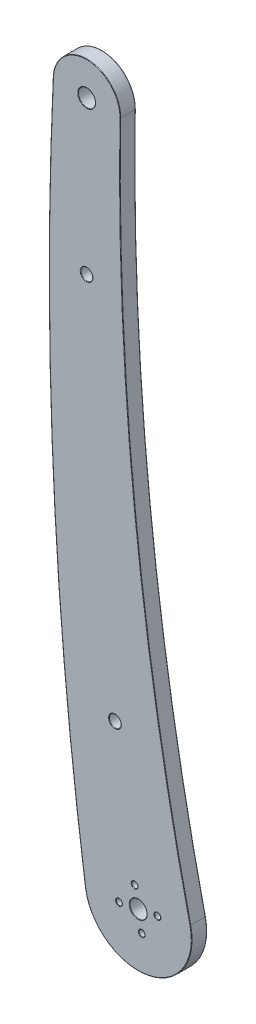
ISO-10303-21;
HEADER;
FILE_DESCRIPTION(('STEP AP214'),'2;1');
FILE_NAME('part.step','',(''),(''),'','','');
FILE_SCHEMA(('AUTOMOTIVE_DESIGN { 1 0 10303 214 1 1 1 1 }'));
ENDSEC;
DATA;
#1=APPLICATION_CONTEXT('core data for automotive mechanical design processes');
#2=APPLICATION_PROTOCOL_DEFINITION('international standard','automotive_design',2000,#1);
#3=PRODUCT_CONTEXT('',#1,'mechanical');
#4=PRODUCT('Part','Part','',(#3));
#5=PRODUCT_RELATED_PRODUCT_CATEGORY('part','',(#4));
#6=PRODUCT_DEFINITION_FORMATION('','',#4);
#7=PRODUCT_DEFINITION_CONTEXT('part definition',#1,'design');
#8=PRODUCT_DEFINITION('design','',#6,#7);
#9=PRODUCT_DEFINITION_SHAPE('','',#8);
#10=(LENGTH_UNIT() NAMED_UNIT(*) SI_UNIT(.MILLI.,.METRE.));
#11=(NAMED_UNIT(*) PLANE_ANGLE_UNIT() SI_UNIT($,.RADIAN.));
#12=(NAMED_UNIT(*) SI_UNIT($,.STERADIAN.) SOLID_ANGLE_UNIT());
#13=UNCERTAINTY_MEASURE_WITH_UNIT(LENGTH_MEASURE(1.E-05),#10,'distance_accuracy_value','');
#14=(GEOMETRIC_REPRESENTATION_CONTEXT(3) GLOBAL_UNCERTAINTY_ASSIGNED_CONTEXT((#13)) GLOBAL_UNIT_ASSIGNED_CONTEXT((#10,
#11,#12)) REPRESENTATION_CONTEXT('',''));
#15=CARTESIAN_POINT('',(0.,0.,0.));
#16=DIRECTION('',(0.,0.,1.));
#17=DIRECTION('',(1.,0.,0.));
#18=AXIS2_PLACEMENT_3D('',#15,#16,#17);
#19=CARTESIAN_POINT('',(-37.0776547455483,278.939028450343,-5.));
#20=DIRECTION('',(0.,0.,1.));
#21=DIRECTION('',(1.,0.,0.));
#22=AXIS2_PLACEMENT_3D('',#19,#20,#21);
#23=CYLINDRICAL_SURFACE('',#22,11.0000000000001);
#24=DIRECTION('',(0.,0.,1.));
#25=VECTOR('',#24,1.);
#26=CARTESIAN_POINT('',(-26.0791673880019,278.756611768298,-5.));
#27=LINE('',#26,#25);
#28=CARTESIAN_POINT('',(-26.0791673880019,278.756611768298,-4.85));
#29=VERTEX_POINT('',#28);
#30=CARTESIAN_POINT('',(-26.0791673880019,278.756611768298,-0.15));
#31=VERTEX_POINT('',#30);
#32=EDGE_CURVE('E111',#29,#31,#27,.T.);
#33=ORIENTED_EDGE('',*,*,#32,.F.);
#34=CARTESIAN_POINT('',(-37.0776547455483,278.939028450343,-4.85));
#35=DIRECTION('',(0.,0.,-1.));
#36=DIRECTION('',(-1.,0.,0.));
#37=AXIS2_PLACEMENT_3D('',#34,#35,#36);
#38=CIRCLE('',#37,11.0000000000001);
#39=CARTESIAN_POINT('',(-48.0655821267615,279.45424866073,-4.85));
#40=VERTEX_POINT('',#39);
#41=EDGE_CURVE('E106',#29,#40,#38,.F.);
#42=ORIENTED_EDGE('',*,*,#41,.T.);
#43=DIRECTION('',(0.,0.,1.));
#44=VECTOR('',#43,1.);
#45=CARTESIAN_POINT('',(-48.0655821267615,279.45424866073,-5.));
#46=LINE('',#45,#44);
#47=CARTESIAN_POINT('',(-48.0655821267615,279.45424866073,-0.15));
#48=VERTEX_POINT('',#47);
#49=EDGE_CURVE('E108',#40,#48,#46,.T.);
#50=ORIENTED_EDGE('',*,*,#49,.T.);
#51=CARTESIAN_POINT('',(-37.0776547455483,278.939028450343,-0.15));
#52=DIRECTION('',(0.,0.,-1.));
#53=DIRECTION('',(-1.,0.,0.));
#54=AXIS2_PLACEMENT_3D('',#51,#52,#53);
#55=CIRCLE('',#54,11.0000000000001);
#56=EDGE_CURVE('E118',#48,#31,#55,.T.);
#57=ORIENTED_EDGE('',*,*,#56,.T.);
#58=EDGE_LOOP('',(#33,#42,#50,#57));
#59=FACE_BOUND('',#58,.T.);
#60=ADVANCED_FACE('F39',(#59),#23,.T.);
#61=CARTESIAN_POINT('',(873.797070956716,263.831610510011,-5.));
#62=DIRECTION('',(0.,0.,1.));
#63=DIRECTION('',(1.,0.,0.));
#64=AXIS2_PLACEMENT_3D('',#61,#62,#63);
#65=CYLINDRICAL_SURFACE('',#64,900.);
#66=DIRECTION('',(0.,0.,1.));
#67=VECTOR('',#66,1.);
#68=CARTESIAN_POINT('',(-3.16790327875482,61.5139544238968,-5.));
#69=LINE('',#68,#67);
#70=CARTESIAN_POINT('',(-3.16790327875482,61.5139544238968,-4.85));
#71=VERTEX_POINT('',#70);
#72=CARTESIAN_POINT('',(-3.16790327875482,61.5139544238968,-0.15));
#73=VERTEX_POINT('',#72);
#74=EDGE_CURVE('E346',#71,#73,#69,.T.);
#75=ORIENTED_EDGE('',*,*,#74,.F.);
#76=CARTESIAN_POINT('',(873.797070956716,263.831610510011,-4.85));
#77=DIRECTION('',(0.,0.,-1.));
#78=DIRECTION('',(-1.,0.,0.));
#79=AXIS2_PLACEMENT_3D('',#76,#77,#78);
#80=CIRCLE('',#79,900.);
#81=EDGE_CURVE('E205',#71,#29,#80,.T.);
#82=ORIENTED_EDGE('',*,*,#81,.T.);
#83=ORIENTED_EDGE('',*,*,#32,.T.);
#84=CARTESIAN_POINT('',(873.797070956716,263.831610510011,-0.15));
#85=DIRECTION('',(0.,0.,-1.));
#86=DIRECTION('',(-1.,0.,0.));
#87=AXIS2_PLACEMENT_3D('',#84,#85,#86);
#88=CIRCLE('',#87,900.);
#89=EDGE_CURVE('E201',#31,#73,#88,.F.);
#90=ORIENTED_EDGE('',*,*,#89,.T.);
#91=EDGE_LOOP('',(#75,#82,#83,#90));
#92=FACE_BOUND('',#91,.T.);
#93=ADVANCED_FACE('F342',(#92),#65,.F.);
#94=CARTESIAN_POINT('',(-20.2199999999997,57.58,-5.));
#95=DIRECTION('',(0.,0.,1.));
#96=DIRECTION('',(1.,0.,0.));
#97=AXIS2_PLACEMENT_3D('',#94,#95,#96);
#98=CYLINDRICAL_SURFACE('',#97,17.4999999999997);
#99=DIRECTION('',(0.,0.,1.));
#100=VECTOR('',#99,1.);
#101=CARTESIAN_POINT('',(-37.5474034553959,55.1282476687248,-5.));
#102=LINE('',#101,#100);
#103=CARTESIAN_POINT('',(-37.5474034553959,55.1282476687248,-4.85));
#104=VERTEX_POINT('',#103);
#105=CARTESIAN_POINT('',(-37.5474034553959,55.1282476687248,-0.15));
#106=VERTEX_POINT('',#105);
#107=EDGE_CURVE('E130',#104,#106,#102,.T.);
#108=ORIENTED_EDGE('',*,*,#107,.F.);
#109=CARTESIAN_POINT('',(-20.2199999999997,57.58,-4.85));
#110=DIRECTION('',(0.,0.,-1.));
#111=DIRECTION('',(-1.,0.,0.));
#112=AXIS2_PLACEMENT_3D('',#109,#110,#111);
#113=CIRCLE('',#112,17.4999999999997);
#114=EDGE_CURVE('E198',#104,#71,#113,.F.);
#115=ORIENTED_EDGE('',*,*,#114,.T.);
#116=ORIENTED_EDGE('',*,*,#74,.T.);
#117=CARTESIAN_POINT('',(-20.2199999999997,57.58,-0.15));
#118=DIRECTION('',(0.,0.,-1.));
#119=DIRECTION('',(-1.,0.,0.));
#120=AXIS2_PLACEMENT_3D('',#117,#118,#119);
#121=CIRCLE('',#120,17.4999999999997);
#122=EDGE_CURVE('E195',#73,#106,#121,.T.);
#123=ORIENTED_EDGE('',*,*,#122,.T.);
#124=EDGE_LOOP('',(#108,#115,#116,#123));
#125=FACE_BOUND('',#124,.T.);
#126=ADVANCED_FACE('F398',(#125),#98,.T.);
#127=CARTESIAN_POINT('',(1150.61740491465,223.248407527602,-5.));
#128=DIRECTION('',(0.,0.,1.));
#129=DIRECTION('',(1.,0.,0.));
#130=AXIS2_PLACEMENT_3D('',#127,#128,#129);
#131=CYLINDRICAL_SURFACE('',#130,1200.);
#132=ORIENTED_EDGE('',*,*,#49,.F.);
#133=CARTESIAN_POINT('',(1150.61740491465,223.248407527602,-4.85));
#134=DIRECTION('',(0.,0.,-1.));
#135=DIRECTION('',(-1.,0.,0.));
#136=AXIS2_PLACEMENT_3D('',#133,#134,#135);
#137=CIRCLE('',#136,1200.);
#138=EDGE_CURVE('E125',#40,#104,#137,.F.);
#139=ORIENTED_EDGE('',*,*,#138,.T.);
#140=ORIENTED_EDGE('',*,*,#107,.T.);
#141=CARTESIAN_POINT('',(1150.61740491465,223.248407527602,-0.15));
#142=DIRECTION('',(0.,0.,-1.));
#143=DIRECTION('',(-1.,0.,0.));
#144=AXIS2_PLACEMENT_3D('',#141,#142,#143);
#145=CIRCLE('',#144,1200.);
#146=EDGE_CURVE('E128',#106,#48,#145,.T.);
#147=ORIENTED_EDGE('',*,*,#146,.T.);
#148=EDGE_LOOP('',(#132,#139,#140,#147));
#149=FACE_BOUND('',#148,.T.);
#150=ADVANCED_FACE('F122',(#149),#131,.T.);
#151=CARTESIAN_POINT('',(418.359708105584,271.385319480177,-5.));
#152=DIRECTION('',(0.,0.,-1.));
#153=DIRECTION('',(-1.,0.,0.));
#154=AXIS2_PLACEMENT_3D('',#151,#152,#153);
#155=PLANE('',#154);
#156=CARTESIAN_POINT('',(-20.2199999999997,57.58,-5.));
#157=DIRECTION('',(0.,0.,-1.));
#158=DIRECTION('',(-1.,0.,0.));
#159=AXIS2_PLACEMENT_3D('',#156,#157,#158);
#160=CIRCLE('',#159,17.3499999999997);
#161=CARTESIAN_POINT('',(-3.31406410779405,61.4802348145491,-5.));
#162=VERTEX_POINT('',#161);
#163=CARTESIAN_POINT('',(-37.3988828543496,55.1492626887071,-5.));
#164=VERTEX_POINT('',#163);
#165=EDGE_CURVE('E189',#162,#164,#160,.T.);
#166=ORIENTED_EDGE('',*,*,#165,.T.);
#167=CARTESIAN_POINT('',(1150.61740491465,223.248407527602,-5.));
#168=DIRECTION('',(0.,0.,-1.));
#169=DIRECTION('',(-1.,0.,0.));
#170=AXIS2_PLACEMENT_3D('',#167,#168,#169);
#171=CIRCLE('',#170,1199.85);
#172=CARTESIAN_POINT('',(-47.9157467533811,279.447222930589,-5.));
#173=VERTEX_POINT('',#172);
#174=EDGE_CURVE('E192',#164,#173,#171,.T.);
#175=ORIENTED_EDGE('',*,*,#174,.T.);
#176=CARTESIAN_POINT('',(-37.0776547455483,278.939028450343,-5.));
#177=DIRECTION('',(0.,0.,-1.));
#178=DIRECTION('',(-1.,0.,0.));
#179=AXIS2_PLACEMENT_3D('',#176,#177,#178);
#180=CIRCLE('',#179,10.8500000000001);
#181=CARTESIAN_POINT('',(-26.2291467610591,278.759099268507,-5.));
#182=VERTEX_POINT('',#181);
#183=EDGE_CURVE('E136',#173,#182,#180,.T.);
#184=ORIENTED_EDGE('',*,*,#183,.T.);
#185=CARTESIAN_POINT('',(873.797070956716,263.831610510011,-5.));
#186=DIRECTION('',(0.,0.,-1.));
#187=DIRECTION('',(-1.,0.,0.));
#188=AXIS2_PLACEMENT_3D('',#185,#186,#187);
#189=CIRCLE('',#188,900.15);
#190=EDGE_CURVE('E186',#182,#162,#189,.F.);
#191=ORIENTED_EDGE('',*,*,#190,.T.);
#192=EDGE_LOOP('',(#166,#175,#184,#191));
#193=FACE_BOUND('',#192,.T.);
#194=CARTESIAN_POINT('',(-20.2199999999997,57.58,-5.));
#195=DIRECTION('',(0.,0.,-1.));
#196=DIRECTION('',(-1.,0.,0.));
#197=AXIS2_PLACEMENT_3D('',#194,#195,#196);
#198=CIRCLE('',#197,2.95);
#199=CARTESIAN_POINT('',(-23.1699999999997,57.58,-5.));
#200=VERTEX_POINT('',#199);
#201=EDGE_CURVE('E180',#200,#200,#198,.F.);
#202=ORIENTED_EDGE('',*,*,#201,.T.);
#203=EDGE_LOOP('',(#202));
#204=FACE_BOUND('',#203,.T.);
#205=CARTESIAN_POINT('',(-37.0776547455483,278.939028450343,-5.));
#206=DIRECTION('',(0.,0.,-1.));
#207=DIRECTION('',(-1.,0.,0.));
#208=AXIS2_PLACEMENT_3D('',#205,#206,#207);
#209=CIRCLE('',#208,2.95000000000001);
#210=CARTESIAN_POINT('',(-40.0276547455483,278.939028450343,-5.));
#211=VERTEX_POINT('',#210);
#212=EDGE_CURVE('E176',#211,#211,#209,.F.);
#213=ORIENTED_EDGE('',*,*,#212,.T.);
#214=EDGE_LOOP('',(#213));
#215=FACE_BOUND('',#214,.T.);
#216=CARTESIAN_POINT('',(-27.8210123611365,106.998868978214,-5.));
#217=DIRECTION('',(0.,0.,-1.));
#218=DIRECTION('',(-1.,0.,0.));
#219=AXIS2_PLACEMENT_3D('',#216,#217,#218);
#220=CIRCLE('',#219,2.1);
#221=CARTESIAN_POINT('',(-29.9210123611365,106.998868978214,-5.));
#222=VERTEX_POINT('',#221);
#223=EDGE_CURVE('E172',#222,#222,#220,.F.);
#224=ORIENTED_EDGE('',*,*,#223,.T.);
#225=EDGE_LOOP('',(#224));
#226=FACE_BOUND('',#225,.T.);
#227=CARTESIAN_POINT('',(-37.1073977935269,228.939037296833,-5.));
#228=DIRECTION('',(0.,0.,-1.));
#229=DIRECTION('',(-1.,0.,0.));
#230=AXIS2_PLACEMENT_3D('',#227,#228,#229);
#231=CIRCLE('',#230,2.1);
#232=CARTESIAN_POINT('',(-39.2073977935269,228.939037296833,-5.));
#233=VERTEX_POINT('',#232);
#234=EDGE_CURVE('E168',#233,#233,#231,.F.);
#235=ORIENTED_EDGE('',*,*,#234,.T.);
#236=EDGE_LOOP('',(#235));
#237=FACE_BOUND('',#236,.T.);
#238=CARTESIAN_POINT('',(-19.0530694017745,51.2974548963875,-5.));
#239=DIRECTION('',(0.,0.,-1.));
#240=DIRECTION('',(-1.,0.,0.));
#241=AXIS2_PLACEMENT_3D('',#238,#239,#240);
#242=CIRCLE('',#241,1.14999999999999);
#243=CARTESIAN_POINT('',(-20.2030694017745,51.2974548963875,-5.));
#244=VERTEX_POINT('',#243);
#245=EDGE_CURVE('E164',#244,#244,#242,.F.);
#246=ORIENTED_EDGE('',*,*,#245,.T.);
#247=EDGE_LOOP('',(#246));
#248=FACE_BOUND('',#247,.T.);
#249=CARTESIAN_POINT('',(-26.5025451036123,56.4130694017748,-5.));
#250=DIRECTION('',(0.,0.,-1.));
#251=DIRECTION('',(-1.,0.,0.));
#252=AXIS2_PLACEMENT_3D('',#249,#250,#251);
#253=CIRCLE('',#252,1.15);
#254=CARTESIAN_POINT('',(-27.6525451036123,56.4130694017748,-5.));
#255=VERTEX_POINT('',#254);
#256=EDGE_CURVE('E160',#255,#255,#253,.F.);
#257=ORIENTED_EDGE('',*,*,#256,.T.);
#258=EDGE_LOOP('',(#257));
#259=FACE_BOUND('',#258,.T.);
#260=CARTESIAN_POINT('',(-21.3869305982249,63.8625451036125,-5.));
#261=DIRECTION('',(0.,0.,-1.));
#262=DIRECTION('',(-1.,0.,0.));
#263=AXIS2_PLACEMENT_3D('',#260,#261,#262);
#264=CIRCLE('',#263,1.14999999999999);
#265=CARTESIAN_POINT('',(-22.5369305982249,63.8625451036125,-5.));
#266=VERTEX_POINT('',#265);
#267=EDGE_CURVE('E153',#266,#266,#264,.F.);
#268=ORIENTED_EDGE('',*,*,#267,.T.);
#269=EDGE_LOOP('',(#268));
#270=FACE_BOUND('',#269,.T.);
#271=CARTESIAN_POINT('',(-13.9374548963872,58.7469305982252,-5.));
#272=DIRECTION('',(0.,0.,-1.));
#273=DIRECTION('',(-1.,0.,0.));
#274=AXIS2_PLACEMENT_3D('',#271,#272,#273);
#275=CIRCLE('',#274,1.15);
#276=CARTESIAN_POINT('',(-15.0874548963872,58.7469305982252,-5.));
#277=VERTEX_POINT('',#276);
#278=EDGE_CURVE('E148',#277,#277,#275,.F.);
#279=ORIENTED_EDGE('',*,*,#278,.T.);
#280=EDGE_LOOP('',(#279));
#281=FACE_BOUND('',#280,.T.);
#282=ADVANCED_FACE('F355',(#193,#204,#215,#226,#237,#248,#259,#270,#281),#155,.T.);
#283=CARTESIAN_POINT('',(418.359708105584,271.385319480177,0.));
#284=DIRECTION('',(0.,0.,-1.));
#285=DIRECTION('',(-1.,0.,0.));
#286=AXIS2_PLACEMENT_3D('',#283,#284,#285);
#287=PLANE('',#286);
#288=CARTESIAN_POINT('',(-20.2199999999997,57.58,0.));
#289=DIRECTION('',(0.,0.,-1.));
#290=DIRECTION('',(-1.,0.,0.));
#291=AXIS2_PLACEMENT_3D('',#288,#289,#290);
#292=CIRCLE('',#291,17.3499999999997);
#293=CARTESIAN_POINT('',(-37.3988828543499,55.1492626887071,0.));
#294=VERTEX_POINT('',#293);
#295=CARTESIAN_POINT('',(-3.31406410779405,61.4802348145491,0.));
#296=VERTEX_POINT('',#295);
#297=EDGE_CURVE('E49',#294,#296,#292,.F.);
#298=ORIENTED_EDGE('',*,*,#297,.T.);
#299=CARTESIAN_POINT('',(873.797070956716,263.831610510011,0.));
#300=DIRECTION('',(0.,0.,-1.));
#301=DIRECTION('',(-1.,0.,0.));
#302=AXIS2_PLACEMENT_3D('',#299,#300,#301);
#303=CIRCLE('',#302,900.15);
#304=CARTESIAN_POINT('',(-26.2291467610591,278.759099268507,0.));
#305=VERTEX_POINT('',#304);
#306=EDGE_CURVE('E11',#296,#305,#303,.T.);
#307=ORIENTED_EDGE('',*,*,#306,.T.);
#308=CARTESIAN_POINT('',(-37.0776547455483,278.939028450343,0.));
#309=DIRECTION('',(0.,0.,-1.));
#310=DIRECTION('',(-1.,0.,0.));
#311=AXIS2_PLACEMENT_3D('',#308,#309,#310);
#312=CIRCLE('',#311,10.8500000000001);
#313=CARTESIAN_POINT('',(-47.9157467533811,279.447222930589,0.));
#314=VERTEX_POINT('',#313);
#315=EDGE_CURVE('E305',#305,#314,#312,.F.);
#316=ORIENTED_EDGE('',*,*,#315,.T.);
#317=CARTESIAN_POINT('',(1150.61740491465,223.248407527602,0.));
#318=DIRECTION('',(0.,0.,-1.));
#319=DIRECTION('',(-1.,0.,0.));
#320=AXIS2_PLACEMENT_3D('',#317,#318,#319);
#321=CIRCLE('',#320,1199.85);
#322=EDGE_CURVE('E60',#314,#294,#321,.F.);
#323=ORIENTED_EDGE('',*,*,#322,.T.);
#324=EDGE_LOOP('',(#298,#307,#316,#323));
#325=FACE_BOUND('',#324,.T.);
#326=CARTESIAN_POINT('',(-20.2199999999997,57.58,0.));
#327=DIRECTION('',(0.,0.,-1.));
#328=DIRECTION('',(-1.,0.,0.));
#329=AXIS2_PLACEMENT_3D('',#326,#327,#328);
#330=CIRCLE('',#329,2.95);
#331=CARTESIAN_POINT('',(-23.1699999999997,57.58,0.));
#332=VERTEX_POINT('',#331);
#333=EDGE_CURVE('E301',#332,#332,#330,.T.);
#334=ORIENTED_EDGE('',*,*,#333,.T.);
#335=EDGE_LOOP('',(#334));
#336=FACE_BOUND('',#335,.T.);
#337=CARTESIAN_POINT('',(-37.0776547455483,278.939028450343,0.));
#338=DIRECTION('',(0.,0.,-1.));
#339=DIRECTION('',(-1.,0.,0.));
#340=AXIS2_PLACEMENT_3D('',#337,#338,#339);
#341=CIRCLE('',#340,2.95000000000001);
#342=CARTESIAN_POINT('',(-40.0276547455483,278.939028450343,0.));
#343=VERTEX_POINT('',#342);
#344=EDGE_CURVE('E297',#343,#343,#341,.T.);
#345=ORIENTED_EDGE('',*,*,#344,.T.);
#346=EDGE_LOOP('',(#345));
#347=FACE_BOUND('',#346,.T.);
#348=CARTESIAN_POINT('',(-27.8210123611365,106.998868978214,0.));
#349=DIRECTION('',(0.,0.,-1.));
#350=DIRECTION('',(-1.,0.,0.));
#351=AXIS2_PLACEMENT_3D('',#348,#349,#350);
#352=CIRCLE('',#351,2.1);
#353=CARTESIAN_POINT('',(-29.9210123611365,106.998868978214,0.));
#354=VERTEX_POINT('',#353);
#355=EDGE_CURVE('E293',#354,#354,#352,.T.);
#356=ORIENTED_EDGE('',*,*,#355,.T.);
#357=EDGE_LOOP('',(#356));
#358=FACE_BOUND('',#357,.T.);
#359=CARTESIAN_POINT('',(-37.1073977935269,228.939037296833,0.));
#360=DIRECTION('',(0.,0.,-1.));
#361=DIRECTION('',(-1.,0.,0.));
#362=AXIS2_PLACEMENT_3D('',#359,#360,#361);
#363=CIRCLE('',#362,2.1);
#364=CARTESIAN_POINT('',(-39.2073977935269,228.939037296833,0.));
#365=VERTEX_POINT('',#364);
#366=EDGE_CURVE('E289',#365,#365,#363,.T.);
#367=ORIENTED_EDGE('',*,*,#366,.T.);
#368=EDGE_LOOP('',(#367));
#369=FACE_BOUND('',#368,.T.);
#370=CARTESIAN_POINT('',(-19.0530694017745,51.2974548963875,0.));
#371=DIRECTION('',(0.,0.,-1.));
#372=DIRECTION('',(-1.,0.,0.));
#373=AXIS2_PLACEMENT_3D('',#370,#371,#372);
#374=CIRCLE('',#373,1.14999999999999);
#375=CARTESIAN_POINT('',(-20.2030694017745,51.2974548963875,0.));
#376=VERTEX_POINT('',#375);
#377=EDGE_CURVE('E285',#376,#376,#374,.T.);
#378=ORIENTED_EDGE('',*,*,#377,.T.);
#379=EDGE_LOOP('',(#378));
#380=FACE_BOUND('',#379,.T.);
#381=CARTESIAN_POINT('',(-26.5025451036123,56.4130694017748,0.));
#382=DIRECTION('',(0.,0.,-1.));
#383=DIRECTION('',(-1.,0.,0.));
#384=AXIS2_PLACEMENT_3D('',#381,#382,#383);
#385=CIRCLE('',#384,1.15);
#386=CARTESIAN_POINT('',(-27.6525451036123,56.4130694017748,0.));
#387=VERTEX_POINT('',#386);
#388=EDGE_CURVE('E281',#387,#387,#385,.T.);
#389=ORIENTED_EDGE('',*,*,#388,.T.);
#390=EDGE_LOOP('',(#389));
#391=FACE_BOUND('',#390,.T.);
#392=CARTESIAN_POINT('',(-21.3869305982249,63.8625451036125,0.));
#393=DIRECTION('',(0.,0.,-1.));
#394=DIRECTION('',(-1.,0.,0.));
#395=AXIS2_PLACEMENT_3D('',#392,#393,#394);
#396=CIRCLE('',#395,1.14999999999999);
#397=CARTESIAN_POINT('',(-22.5369305982249,63.8625451036125,0.));
#398=VERTEX_POINT('',#397);
#399=EDGE_CURVE('E277',#398,#398,#396,.T.);
#400=ORIENTED_EDGE('',*,*,#399,.T.);
#401=EDGE_LOOP('',(#400));
#402=FACE_BOUND('',#401,.T.);
#403=CARTESIAN_POINT('',(-13.9374548963872,58.7469305982252,0.));
#404=DIRECTION('',(0.,0.,-1.));
#405=DIRECTION('',(-1.,0.,0.));
#406=AXIS2_PLACEMENT_3D('',#403,#404,#405);
#407=CIRCLE('',#406,1.15);
#408=CARTESIAN_POINT('',(-15.0874548963872,58.7469305982252,0.));
#409=VERTEX_POINT('',#408);
#410=EDGE_CURVE('E273',#409,#409,#407,.T.);
#411=ORIENTED_EDGE('',*,*,#410,.T.);
#412=EDGE_LOOP('',(#411));
#413=FACE_BOUND('',#412,.T.);
#414=ADVANCED_FACE('F351',(#325,#336,#347,#358,#369,#380,#391,#402,#413),#287,.F.);
#415=CARTESIAN_POINT('',(-20.2199999999997,57.58,-5.));
#416=DIRECTION('',(0.,0.,1.));
#417=DIRECTION('',(1.,0.,0.));
#418=AXIS2_PLACEMENT_3D('',#415,#416,#417);
#419=CYLINDRICAL_SURFACE('',#418,2.8);
#420=CARTESIAN_POINT('',(-20.2199999999997,57.58,-4.85));
#421=DIRECTION('',(0.,0.,-1.));
#422=DIRECTION('',(-1.,0.,0.));
#423=AXIS2_PLACEMENT_3D('',#420,#421,#422);
#424=CIRCLE('',#423,2.8);
#425=CARTESIAN_POINT('',(-23.0199999999997,57.58,-4.85));
#426=VERTEX_POINT('',#425);
#427=EDGE_CURVE('E213',#426,#426,#424,.T.);
#428=ORIENTED_EDGE('',*,*,#427,.T.);
#429=EDGE_LOOP('',(#428));
#430=FACE_BOUND('',#429,.T.);
#431=CARTESIAN_POINT('',(-20.2199999999997,57.58,-0.15));
#432=DIRECTION('',(0.,0.,-1.));
#433=DIRECTION('',(-1.,0.,0.));
#434=AXIS2_PLACEMENT_3D('',#431,#432,#433);
#435=CIRCLE('',#434,2.8);
#436=CARTESIAN_POINT('',(-23.0199999999997,57.58,-0.15));
#437=VERTEX_POINT('',#436);
#438=EDGE_CURVE('E117',#437,#437,#435,.F.);
#439=ORIENTED_EDGE('',*,*,#438,.T.);
#440=EDGE_LOOP('',(#439));
#441=FACE_BOUND('',#440,.T.);
#442=ADVANCED_FACE('F354',(#430,#441),#419,.F.);
#443=CARTESIAN_POINT('',(-37.0776547455483,278.939028450343,-5.));
#444=DIRECTION('',(0.,0.,1.));
#445=DIRECTION('',(1.,0.,0.));
#446=AXIS2_PLACEMENT_3D('',#443,#444,#445);
#447=CYLINDRICAL_SURFACE('',#446,2.80000000000001);
#448=CARTESIAN_POINT('',(-37.0776547455483,278.939028450343,-4.85));
#449=DIRECTION('',(0.,0.,-1.));
#450=DIRECTION('',(-1.,0.,0.));
#451=AXIS2_PLACEMENT_3D('',#448,#449,#450);
#452=CIRCLE('',#451,2.80000000000001);
#453=CARTESIAN_POINT('',(-39.8776547455483,278.939028450343,-4.85));
#454=VERTEX_POINT('',#453);
#455=EDGE_CURVE('E221',#454,#454,#452,.T.);
#456=ORIENTED_EDGE('',*,*,#455,.T.);
#457=EDGE_LOOP('',(#456));
#458=FACE_BOUND('',#457,.T.);
#459=CARTESIAN_POINT('',(-37.0776547455483,278.939028450343,-0.15));
#460=DIRECTION('',(0.,0.,-1.));
#461=DIRECTION('',(-1.,0.,0.));
#462=AXIS2_PLACEMENT_3D('',#459,#460,#461);
#463=CIRCLE('',#462,2.80000000000001);
#464=CARTESIAN_POINT('',(-39.8776547455483,278.939028450343,-0.15));
#465=VERTEX_POINT('',#464);
#466=EDGE_CURVE('E217',#465,#465,#463,.F.);
#467=ORIENTED_EDGE('',*,*,#466,.T.);
#468=EDGE_LOOP('',(#467));
#469=FACE_BOUND('',#468,.T.);
#470=ADVANCED_FACE('F644',(#458,#469),#447,.F.);
#471=CARTESIAN_POINT('',(-27.8210123611365,106.998868978214,-5.));
#472=DIRECTION('',(0.,0.,1.));
#473=DIRECTION('',(1.,0.,0.));
#474=AXIS2_PLACEMENT_3D('',#471,#472,#473);
#475=CYLINDRICAL_SURFACE('',#474,1.95);
#476=CARTESIAN_POINT('',(-27.8210123611365,106.998868978214,-4.85));
#477=DIRECTION('',(0.,0.,-1.));
#478=DIRECTION('',(-1.,0.,0.));
#479=AXIS2_PLACEMENT_3D('',#476,#477,#478);
#480=CIRCLE('',#479,1.95);
#481=CARTESIAN_POINT('',(-29.7710123611365,106.998868978214,-4.85));
#482=VERTEX_POINT('',#481);
#483=EDGE_CURVE('E229',#482,#482,#480,.T.);
#484=ORIENTED_EDGE('',*,*,#483,.T.);
#485=EDGE_LOOP('',(#484));
#486=FACE_BOUND('',#485,.T.);
#487=CARTESIAN_POINT('',(-27.8210123611365,106.998868978214,-0.15));
#488=DIRECTION('',(0.,0.,-1.));
#489=DIRECTION('',(-1.,0.,0.));
#490=AXIS2_PLACEMENT_3D('',#487,#488,#489);
#491=CIRCLE('',#490,1.95);
#492=CARTESIAN_POINT('',(-29.7710123611365,106.998868978214,-0.15));
#493=VERTEX_POINT('',#492);
#494=EDGE_CURVE('E225',#493,#493,#491,.F.);
#495=ORIENTED_EDGE('',*,*,#494,.T.);
#496=EDGE_LOOP('',(#495));
#497=FACE_BOUND('',#496,.T.);
#498=ADVANCED_FACE('F635',(#486,#497),#475,.F.);
#499=CARTESIAN_POINT('',(-37.1073977935269,228.939037296833,-5.));
#500=DIRECTION('',(0.,0.,1.));
#501=DIRECTION('',(1.,0.,0.));
#502=AXIS2_PLACEMENT_3D('',#499,#500,#501);
#503=CYLINDRICAL_SURFACE('',#502,1.95);
#504=CARTESIAN_POINT('',(-37.1073977935269,228.939037296833,-4.85));
#505=DIRECTION('',(0.,0.,-1.));
#506=DIRECTION('',(-1.,0.,0.));
#507=AXIS2_PLACEMENT_3D('',#504,#505,#506);
#508=CIRCLE('',#507,1.95);
#509=CARTESIAN_POINT('',(-39.0573977935269,228.939037296833,-4.85));
#510=VERTEX_POINT('',#509);
#511=EDGE_CURVE('E237',#510,#510,#508,.T.);
#512=ORIENTED_EDGE('',*,*,#511,.T.);
#513=EDGE_LOOP('',(#512));
#514=FACE_BOUND('',#513,.T.);
#515=CARTESIAN_POINT('',(-37.1073977935269,228.939037296833,-0.15));
#516=DIRECTION('',(0.,0.,-1.));
#517=DIRECTION('',(-1.,0.,0.));
#518=AXIS2_PLACEMENT_3D('',#515,#516,#517);
#519=CIRCLE('',#518,1.95);
#520=CARTESIAN_POINT('',(-39.0573977935269,228.939037296833,-0.15));
#521=VERTEX_POINT('',#520);
#522=EDGE_CURVE('E233',#521,#521,#519,.F.);
#523=ORIENTED_EDGE('',*,*,#522,.T.);
#524=EDGE_LOOP('',(#523));
#525=FACE_BOUND('',#524,.T.);
#526=ADVANCED_FACE('F626',(#514,#525),#503,.F.);
#527=CARTESIAN_POINT('',(-19.0530694017745,51.2974548963875,-5.));
#528=DIRECTION('',(0.,0.,1.));
#529=DIRECTION('',(1.,0.,0.));
#530=AXIS2_PLACEMENT_3D('',#527,#528,#529);
#531=CYLINDRICAL_SURFACE('',#530,0.99999999999999);
#532=CARTESIAN_POINT('',(-19.0530694017745,51.2974548963875,-4.85));
#533=DIRECTION('',(0.,0.,-1.));
#534=DIRECTION('',(-1.,0.,0.));
#535=AXIS2_PLACEMENT_3D('',#532,#533,#534);
#536=CIRCLE('',#535,0.99999999999999);
#537=CARTESIAN_POINT('',(-20.0530694017745,51.2974548963875,-4.85));
#538=VERTEX_POINT('',#537);
#539=EDGE_CURVE('E245',#538,#538,#536,.T.);
#540=ORIENTED_EDGE('',*,*,#539,.T.);
#541=EDGE_LOOP('',(#540));
#542=FACE_BOUND('',#541,.T.);
#543=CARTESIAN_POINT('',(-19.0530694017745,51.2974548963875,-0.15));
#544=DIRECTION('',(0.,0.,-1.));
#545=DIRECTION('',(-1.,0.,0.));
#546=AXIS2_PLACEMENT_3D('',#543,#544,#545);
#547=CIRCLE('',#546,0.99999999999999);
#548=CARTESIAN_POINT('',(-20.0530694017745,51.2974548963875,-0.15));
#549=VERTEX_POINT('',#548);
#550=EDGE_CURVE('E241',#549,#549,#547,.F.);
#551=ORIENTED_EDGE('',*,*,#550,.T.);
#552=EDGE_LOOP('',(#551));
#553=FACE_BOUND('',#552,.T.);
#554=ADVANCED_FACE('F617',(#542,#553),#531,.F.);
#555=CARTESIAN_POINT('',(-26.5025451036123,56.4130694017748,-5.));
#556=DIRECTION('',(0.,0.,1.));
#557=DIRECTION('',(1.,0.,0.));
#558=AXIS2_PLACEMENT_3D('',#555,#556,#557);
#559=CYLINDRICAL_SURFACE('',#558,1.);
#560=CARTESIAN_POINT('',(-26.5025451036123,56.4130694017748,-4.85));
#561=DIRECTION('',(0.,0.,-1.));
#562=DIRECTION('',(-1.,0.,0.));
#563=AXIS2_PLACEMENT_3D('',#560,#561,#562);
#564=CIRCLE('',#563,1.);
#565=CARTESIAN_POINT('',(-27.5025451036123,56.4130694017748,-4.85));
#566=VERTEX_POINT('',#565);
#567=EDGE_CURVE('E253',#566,#566,#564,.T.);
#568=ORIENTED_EDGE('',*,*,#567,.T.);
#569=EDGE_LOOP('',(#568));
#570=FACE_BOUND('',#569,.T.);
#571=CARTESIAN_POINT('',(-26.5025451036123,56.4130694017748,-0.15));
#572=DIRECTION('',(0.,0.,-1.));
#573=DIRECTION('',(-1.,0.,0.));
#574=AXIS2_PLACEMENT_3D('',#571,#572,#573);
#575=CIRCLE('',#574,1.);
#576=CARTESIAN_POINT('',(-27.5025451036123,56.4130694017748,-0.15));
#577=VERTEX_POINT('',#576);
#578=EDGE_CURVE('E249',#577,#577,#575,.F.);
#579=ORIENTED_EDGE('',*,*,#578,.T.);
#580=EDGE_LOOP('',(#579));
#581=FACE_BOUND('',#580,.T.);
#582=ADVANCED_FACE('F390',(#570,#581),#559,.F.);
#583=CARTESIAN_POINT('',(-21.3869305982249,63.8625451036125,-5.));
#584=DIRECTION('',(0.,0.,1.));
#585=DIRECTION('',(1.,0.,0.));
#586=AXIS2_PLACEMENT_3D('',#583,#584,#585);
#587=CYLINDRICAL_SURFACE('',#586,0.99999999999999);
#588=CARTESIAN_POINT('',(-21.3869305982249,63.8625451036125,-4.85));
#589=DIRECTION('',(0.,0.,-1.));
#590=DIRECTION('',(-1.,0.,0.));
#591=AXIS2_PLACEMENT_3D('',#588,#589,#590);
#592=CIRCLE('',#591,0.99999999999999);
#593=CARTESIAN_POINT('',(-22.3869305982249,63.8625451036125,-4.85));
#594=VERTEX_POINT('',#593);
#595=EDGE_CURVE('E261',#594,#594,#592,.T.);
#596=ORIENTED_EDGE('',*,*,#595,.T.);
#597=EDGE_LOOP('',(#596));
#598=FACE_BOUND('',#597,.T.);
#599=CARTESIAN_POINT('',(-21.3869305982249,63.8625451036125,-0.15));
#600=DIRECTION('',(0.,0.,-1.));
#601=DIRECTION('',(-1.,0.,0.));
#602=AXIS2_PLACEMENT_3D('',#599,#600,#601);
#603=CIRCLE('',#602,0.99999999999999);
#604=CARTESIAN_POINT('',(-22.3869305982249,63.8625451036125,-0.15));
#605=VERTEX_POINT('',#604);
#606=EDGE_CURVE('E257',#605,#605,#603,.F.);
#607=ORIENTED_EDGE('',*,*,#606,.T.);
#608=EDGE_LOOP('',(#607));
#609=FACE_BOUND('',#608,.T.);
#610=ADVANCED_FACE('F381',(#598,#609),#587,.F.);
#611=CARTESIAN_POINT('',(-13.9374548963872,58.7469305982252,-5.));
#612=DIRECTION('',(0.,0.,1.));
#613=DIRECTION('',(1.,0.,0.));
#614=AXIS2_PLACEMENT_3D('',#611,#612,#613);
#615=CYLINDRICAL_SURFACE('',#614,1.);
#616=CARTESIAN_POINT('',(-13.9374548963872,58.7469305982252,-4.85));
#617=DIRECTION('',(0.,0.,-1.));
#618=DIRECTION('',(-1.,0.,0.));
#619=AXIS2_PLACEMENT_3D('',#616,#617,#618);
#620=CIRCLE('',#619,1.);
#621=CARTESIAN_POINT('',(-14.9374548963872,58.7469305982252,-4.85));
#622=VERTEX_POINT('',#621);
#623=EDGE_CURVE('E269',#622,#622,#620,.T.);
#624=ORIENTED_EDGE('',*,*,#623,.T.);
#625=EDGE_LOOP('',(#624));
#626=FACE_BOUND('',#625,.T.);
#627=CARTESIAN_POINT('',(-13.9374548963872,58.7469305982252,-0.15));
#628=DIRECTION('',(0.,0.,-1.));
#629=DIRECTION('',(-1.,0.,0.));
#630=AXIS2_PLACEMENT_3D('',#627,#628,#629);
#631=CIRCLE('',#630,1.);
#632=CARTESIAN_POINT('',(-14.9374548963872,58.7469305982252,-0.15));
#633=VERTEX_POINT('',#632);
#634=EDGE_CURVE('E265',#633,#633,#631,.F.);
#635=ORIENTED_EDGE('',*,*,#634,.T.);
#636=EDGE_LOOP('',(#635));
#637=FACE_BOUND('',#636,.T.);
#638=ADVANCED_FACE('F378',(#626,#637),#615,.F.);
#639=CARTESIAN_POINT('',(873.797070956716,263.831610510011,-4.85));
#640=DIRECTION('',(0.,0.,-1.));
#641=DIRECTION('',(-1.,0.,0.));
#642=AXIS2_PLACEMENT_3D('',#639,#640,#641);
#643=TOROIDAL_SURFACE('',#642,900.15,0.15);
#644=CARTESIAN_POINT('',(-3.31406410779405,61.4802348145491,-4.85));
#645=DIRECTION('',(0.224797395651233,-0.974405526928302,0.));
#646=DIRECTION('',(0.974405526928303,0.224797395651233,0.));
#647=AXIS2_PLACEMENT_3D('',#644,#645,#646);
#648=CIRCLE('',#647,0.15);
#649=EDGE_CURVE('E141',#162,#71,#648,.T.);
#650=ORIENTED_EDGE('',*,*,#649,.F.);
#651=ORIENTED_EDGE('',*,*,#190,.F.);
#652=CARTESIAN_POINT('',(-26.2291467610593,278.759099268507,-4.85));
#653=DIRECTION('',(0.0165833347313496,0.999862487049688,0.));
#654=DIRECTION('',(-0.999862487049688,0.0165833347313496,0.));
#655=AXIS2_PLACEMENT_3D('',#652,#653,#654);
#656=CIRCLE('',#655,0.15);
#657=EDGE_CURVE('E131',#29,#182,#656,.T.);
#658=ORIENTED_EDGE('',*,*,#657,.F.);
#659=ORIENTED_EDGE('',*,*,#81,.F.);
#660=EDGE_LOOP('',(#650,#651,#658,#659));
#661=FACE_BOUND('',#660,.T.);
#662=ADVANCED_FACE('F380',(#661),#643,.T.);
#663=CARTESIAN_POINT('',(-37.0776547455483,278.939028450343,-4.85));
#664=DIRECTION('',(0.,0.,-1.));
#665=DIRECTION('',(-1.,0.,0.));
#666=AXIS2_PLACEMENT_3D('',#663,#664,#665);
#667=TOROIDAL_SURFACE('',#666,10.8500000000001,0.15);
#668=ORIENTED_EDGE('',*,*,#657,.T.);
#669=ORIENTED_EDGE('',*,*,#183,.F.);
#670=CARTESIAN_POINT('',(-47.9157467533811,279.447222930589,-4.85));
#671=DIRECTION('',(-0.0468382009444214,-0.998902489201168,0.));
#672=DIRECTION('',(0.998902489201168,-0.0468382009444214,0.));
#673=AXIS2_PLACEMENT_3D('',#670,#671,#672);
#674=CIRCLE('',#673,0.15);
#675=EDGE_CURVE('E134',#40,#173,#674,.T.);
#676=ORIENTED_EDGE('',*,*,#675,.F.);
#677=ORIENTED_EDGE('',*,*,#41,.F.);
#678=EDGE_LOOP('',(#668,#669,#676,#677));
#679=FACE_BOUND('',#678,.T.);
#680=ADVANCED_FACE('F135',(#679),#667,.T.);
#681=CARTESIAN_POINT('',(-20.2199999999997,57.58,-4.85));
#682=DIRECTION('',(0.,0.,-1.));
#683=DIRECTION('',(-1.,0.,0.));
#684=AXIS2_PLACEMENT_3D('',#681,#682,#683);
#685=TOROIDAL_SURFACE('',#684,17.3499999999997,0.15);
#686=ORIENTED_EDGE('',*,*,#649,.T.);
#687=ORIENTED_EDGE('',*,*,#114,.F.);
#688=CARTESIAN_POINT('',(-37.3988828543496,55.1492626887071,-4.85));
#689=DIRECTION('',(-0.140100133215795,0.990137340308362,0.));
#690=DIRECTION('',(-0.990137340308362,-0.140100133215795,0.));
#691=AXIS2_PLACEMENT_3D('',#688,#689,#690);
#692=CIRCLE('',#691,0.15);
#693=EDGE_CURVE('E142',#164,#104,#692,.T.);
#694=ORIENTED_EDGE('',*,*,#693,.F.);
#695=ORIENTED_EDGE('',*,*,#165,.F.);
#696=EDGE_LOOP('',(#686,#687,#694,#695));
#697=FACE_BOUND('',#696,.T.);
#698=ADVANCED_FACE('F406',(#697),#685,.T.);
#699=CARTESIAN_POINT('',(1150.61740491465,223.248407527602,-4.85));
#700=DIRECTION('',(0.,0.,-1.));
#701=DIRECTION('',(-1.,0.,0.));
#702=AXIS2_PLACEMENT_3D('',#699,#700,#701);
#703=TOROIDAL_SURFACE('',#702,1199.85,0.15);
#704=ORIENTED_EDGE('',*,*,#675,.T.);
#705=ORIENTED_EDGE('',*,*,#174,.F.);
#706=ORIENTED_EDGE('',*,*,#693,.T.);
#707=ORIENTED_EDGE('',*,*,#138,.F.);
#708=EDGE_LOOP('',(#704,#705,#706,#707));
#709=FACE_BOUND('',#708,.T.);
#710=ADVANCED_FACE('F144',(#709),#703,.T.);
#711=CARTESIAN_POINT('',(-20.2199999999997,57.58,-4.85));
#712=DIRECTION('',(0.,0.,-1.));
#713=DIRECTION('',(-1.,0.,0.));
#714=AXIS2_PLACEMENT_3D('',#711,#712,#713);
#715=TOROIDAL_SURFACE('',#714,2.95,0.15);
#716=ORIENTED_EDGE('',*,*,#427,.F.);
#717=EDGE_LOOP('',(#716));
#718=FACE_BOUND('',#717,.T.);
#719=ORIENTED_EDGE('',*,*,#201,.F.);
#720=EDGE_LOOP('',(#719));
#721=FACE_BOUND('',#720,.T.);
#722=ADVANCED_FACE('F405',(#718,#721),#715,.T.);
#723=CARTESIAN_POINT('',(-37.0776547455483,278.939028450343,-4.85));
#724=DIRECTION('',(0.,0.,-1.));
#725=DIRECTION('',(-1.,0.,0.));
#726=AXIS2_PLACEMENT_3D('',#723,#724,#725);
#727=TOROIDAL_SURFACE('',#726,2.95000000000001,0.15);
#728=ORIENTED_EDGE('',*,*,#455,.F.);
#729=EDGE_LOOP('',(#728));
#730=FACE_BOUND('',#729,.T.);
#731=ORIENTED_EDGE('',*,*,#212,.F.);
#732=EDGE_LOOP('',(#731));
#733=FACE_BOUND('',#732,.T.);
#734=ADVANCED_FACE('F414',(#730,#733),#727,.T.);
#735=CARTESIAN_POINT('',(-27.8210123611365,106.998868978214,-4.85));
#736=DIRECTION('',(0.,0.,-1.));
#737=DIRECTION('',(-1.,0.,0.));
#738=AXIS2_PLACEMENT_3D('',#735,#736,#737);
#739=TOROIDAL_SURFACE('',#738,2.1,0.15);
#740=ORIENTED_EDGE('',*,*,#483,.F.);
#741=EDGE_LOOP('',(#740));
#742=FACE_BOUND('',#741,.T.);
#743=ORIENTED_EDGE('',*,*,#223,.F.);
#744=EDGE_LOOP('',(#743));
#745=FACE_BOUND('',#744,.T.);
#746=ADVANCED_FACE('F418',(#742,#745),#739,.T.);
#747=CARTESIAN_POINT('',(-37.1073977935269,228.939037296833,-4.85));
#748=DIRECTION('',(0.,0.,-1.));
#749=DIRECTION('',(-1.,0.,0.));
#750=AXIS2_PLACEMENT_3D('',#747,#748,#749);
#751=TOROIDAL_SURFACE('',#750,2.1,0.15);
#752=ORIENTED_EDGE('',*,*,#511,.F.);
#753=EDGE_LOOP('',(#752));
#754=FACE_BOUND('',#753,.T.);
#755=ORIENTED_EDGE('',*,*,#234,.F.);
#756=EDGE_LOOP('',(#755));
#757=FACE_BOUND('',#756,.T.);
#758=ADVANCED_FACE('F422',(#754,#757),#751,.T.);
#759=CARTESIAN_POINT('',(-19.0530694017745,51.2974548963875,-4.85));
#760=DIRECTION('',(0.,0.,-1.));
#761=DIRECTION('',(-1.,0.,0.));
#762=AXIS2_PLACEMENT_3D('',#759,#760,#761);
#763=TOROIDAL_SURFACE('',#762,1.14999999999999,0.15);
#764=ORIENTED_EDGE('',*,*,#539,.F.);
#765=EDGE_LOOP('',(#764));
#766=FACE_BOUND('',#765,.T.);
#767=ORIENTED_EDGE('',*,*,#245,.F.);
#768=EDGE_LOOP('',(#767));
#769=FACE_BOUND('',#768,.T.);
#770=ADVANCED_FACE('F426',(#766,#769),#763,.T.);
#771=CARTESIAN_POINT('',(-26.5025451036123,56.4130694017748,-4.85));
#772=DIRECTION('',(0.,0.,-1.));
#773=DIRECTION('',(-1.,0.,0.));
#774=AXIS2_PLACEMENT_3D('',#771,#772,#773);
#775=TOROIDAL_SURFACE('',#774,1.15,0.15);
#776=ORIENTED_EDGE('',*,*,#567,.F.);
#777=EDGE_LOOP('',(#776));
#778=FACE_BOUND('',#777,.T.);
#779=ORIENTED_EDGE('',*,*,#256,.F.);
#780=EDGE_LOOP('',(#779));
#781=FACE_BOUND('',#780,.T.);
#782=ADVANCED_FACE('F430',(#778,#781),#775,.T.);
#783=CARTESIAN_POINT('',(-21.3869305982249,63.8625451036125,-4.85));
#784=DIRECTION('',(0.,0.,-1.));
#785=DIRECTION('',(-1.,0.,0.));
#786=AXIS2_PLACEMENT_3D('',#783,#784,#785);
#787=TOROIDAL_SURFACE('',#786,1.14999999999999,0.15);
#788=ORIENTED_EDGE('',*,*,#595,.F.);
#789=EDGE_LOOP('',(#788));
#790=FACE_BOUND('',#789,.T.);
#791=ORIENTED_EDGE('',*,*,#267,.F.);
#792=EDGE_LOOP('',(#791));
#793=FACE_BOUND('',#792,.T.);
#794=ADVANCED_FACE('F434',(#790,#793),#787,.T.);
#795=CARTESIAN_POINT('',(-13.9374548963872,58.7469305982252,-4.85));
#796=DIRECTION('',(0.,0.,-1.));
#797=DIRECTION('',(-1.,0.,0.));
#798=AXIS2_PLACEMENT_3D('',#795,#796,#797);
#799=TOROIDAL_SURFACE('',#798,1.15,0.15);
#800=ORIENTED_EDGE('',*,*,#623,.F.);
#801=EDGE_LOOP('',(#800));
#802=FACE_BOUND('',#801,.T.);
#803=ORIENTED_EDGE('',*,*,#278,.F.);
#804=EDGE_LOOP('',(#803));
#805=FACE_BOUND('',#804,.T.);
#806=ADVANCED_FACE('F438',(#802,#805),#799,.T.);
#807=CARTESIAN_POINT('',(1150.61740491465,223.248407527602,-0.15));
#808=DIRECTION('',(0.,0.,-1.));
#809=DIRECTION('',(-1.,0.,0.));
#810=AXIS2_PLACEMENT_3D('',#807,#808,#809);
#811=TOROIDAL_SURFACE('',#810,1199.85,0.15);
#812=CARTESIAN_POINT('',(-47.9157467533813,279.447222930589,-0.15));
#813=DIRECTION('',(0.0468382009444214,0.998902489201168,0.));
#814=DIRECTION('',(-0.998902489201168,0.0468382009444214,0.));
#815=AXIS2_PLACEMENT_3D('',#812,#813,#814);
#816=CIRCLE('',#815,0.15);
#817=EDGE_CURVE('E324',#48,#314,#816,.T.);
#818=ORIENTED_EDGE('',*,*,#817,.F.);
#819=ORIENTED_EDGE('',*,*,#146,.F.);
#820=CARTESIAN_POINT('',(-37.3988828543499,55.1492626887071,-0.15));
#821=DIRECTION('',(0.140100133215774,-0.990137340308365,0.));
#822=DIRECTION('',(0.990137340308365,0.140100133215774,0.));
#823=AXIS2_PLACEMENT_3D('',#820,#821,#822);
#824=CIRCLE('',#823,0.15);
#825=EDGE_CURVE('E43',#294,#106,#824,.T.);
#826=ORIENTED_EDGE('',*,*,#825,.F.);
#827=ORIENTED_EDGE('',*,*,#322,.F.);
#828=EDGE_LOOP('',(#818,#819,#826,#827));
#829=FACE_BOUND('',#828,.T.);
#830=ADVANCED_FACE('F336',(#829),#811,.T.);
#831=CARTESIAN_POINT('',(-20.2199999999997,57.58,-0.15));
#832=DIRECTION('',(0.,0.,-1.));
#833=DIRECTION('',(-1.,0.,0.));
#834=AXIS2_PLACEMENT_3D('',#831,#832,#833);
#835=TOROIDAL_SURFACE('',#834,17.3499999999997,0.15);
#836=ORIENTED_EDGE('',*,*,#825,.T.);
#837=ORIENTED_EDGE('',*,*,#122,.F.);
#838=CARTESIAN_POINT('',(-3.31406410779405,61.4802348145491,-0.15));
#839=DIRECTION('',(-0.224797395651233,0.974405526928303,0.));
#840=DIRECTION('',(-0.974405526928303,-0.224797395651233,0.));
#841=AXIS2_PLACEMENT_3D('',#838,#839,#840);
#842=CIRCLE('',#841,0.15);
#843=EDGE_CURVE('E322',#296,#73,#842,.T.);
#844=ORIENTED_EDGE('',*,*,#843,.F.);
#845=ORIENTED_EDGE('',*,*,#297,.F.);
#846=EDGE_LOOP('',(#836,#837,#844,#845));
#847=FACE_BOUND('',#846,.T.);
#848=ADVANCED_FACE('F334',(#847),#835,.T.);
#849=CARTESIAN_POINT('',(-37.0776547455483,278.939028450343,-0.15));
#850=DIRECTION('',(0.,0.,-1.));
#851=DIRECTION('',(-1.,0.,0.));
#852=AXIS2_PLACEMENT_3D('',#849,#850,#851);
#853=TOROIDAL_SURFACE('',#852,10.8500000000001,0.15);
#854=ORIENTED_EDGE('',*,*,#817,.T.);
#855=ORIENTED_EDGE('',*,*,#315,.F.);
#856=CARTESIAN_POINT('',(-26.2291467610591,278.759099268507,-0.15));
#857=DIRECTION('',(-0.0165833347313496,-0.999862487049688,0.));
#858=DIRECTION('',(0.999862487049688,-0.0165833347313496,0.));
#859=AXIS2_PLACEMENT_3D('',#856,#857,#858);
#860=CIRCLE('',#859,0.15);
#861=EDGE_CURVE('E319',#31,#305,#860,.T.);
#862=ORIENTED_EDGE('',*,*,#861,.F.);
#863=ORIENTED_EDGE('',*,*,#56,.F.);
#864=EDGE_LOOP('',(#854,#855,#862,#863));
#865=FACE_BOUND('',#864,.T.);
#866=ADVANCED_FACE('F338',(#865),#853,.T.);
#867=CARTESIAN_POINT('',(873.797070956716,263.831610510011,-0.15));
#868=DIRECTION('',(0.,0.,-1.));
#869=DIRECTION('',(-1.,0.,0.));
#870=AXIS2_PLACEMENT_3D('',#867,#868,#869);
#871=TOROIDAL_SURFACE('',#870,900.15,0.15);
#872=ORIENTED_EDGE('',*,*,#843,.T.);
#873=ORIENTED_EDGE('',*,*,#89,.F.);
#874=ORIENTED_EDGE('',*,*,#861,.T.);
#875=ORIENTED_EDGE('',*,*,#306,.F.);
#876=EDGE_LOOP('',(#872,#873,#874,#875));
#877=FACE_BOUND('',#876,.T.);
#878=ADVANCED_FACE('F349',(#877),#871,.T.);
#879=CARTESIAN_POINT('',(-20.2199999999997,57.58,-0.15));
#880=DIRECTION('',(0.,0.,-1.));
#881=DIRECTION('',(-1.,0.,0.));
#882=AXIS2_PLACEMENT_3D('',#879,#880,#881);
#883=TOROIDAL_SURFACE('',#882,2.95,0.15);
#884=ORIENTED_EDGE('',*,*,#333,.F.);
#885=EDGE_LOOP('',(#884));
#886=FACE_BOUND('',#885,.T.);
#887=ORIENTED_EDGE('',*,*,#438,.F.);
#888=EDGE_LOOP('',(#887));
#889=FACE_BOUND('',#888,.T.);
#890=ADVANCED_FACE('F445',(#886,#889),#883,.T.);
#891=CARTESIAN_POINT('',(-37.0776547455483,278.939028450343,-0.15));
#892=DIRECTION('',(0.,0.,-1.));
#893=DIRECTION('',(-1.,0.,0.));
#894=AXIS2_PLACEMENT_3D('',#891,#892,#893);
#895=TOROIDAL_SURFACE('',#894,2.95000000000001,0.15);
#896=ORIENTED_EDGE('',*,*,#344,.F.);
#897=EDGE_LOOP('',(#896));
#898=FACE_BOUND('',#897,.T.);
#899=ORIENTED_EDGE('',*,*,#466,.F.);
#900=EDGE_LOOP('',(#899));
#901=FACE_BOUND('',#900,.T.);
#902=ADVANCED_FACE('F454',(#898,#901),#895,.T.);
#903=CARTESIAN_POINT('',(-27.8210123611365,106.998868978214,-0.15));
#904=DIRECTION('',(0.,0.,-1.));
#905=DIRECTION('',(-1.,0.,0.));
#906=AXIS2_PLACEMENT_3D('',#903,#904,#905);
#907=TOROIDAL_SURFACE('',#906,2.1,0.15);
#908=ORIENTED_EDGE('',*,*,#355,.F.);
#909=EDGE_LOOP('',(#908));
#910=FACE_BOUND('',#909,.T.);
#911=ORIENTED_EDGE('',*,*,#494,.F.);
#912=EDGE_LOOP('',(#911));
#913=FACE_BOUND('',#912,.T.);
#914=ADVANCED_FACE('F458',(#910,#913),#907,.T.);
#915=CARTESIAN_POINT('',(-37.1073977935269,228.939037296833,-0.15));
#916=DIRECTION('',(0.,0.,-1.));
#917=DIRECTION('',(-1.,0.,0.));
#918=AXIS2_PLACEMENT_3D('',#915,#916,#917);
#919=TOROIDAL_SURFACE('',#918,2.1,0.15);
#920=ORIENTED_EDGE('',*,*,#366,.F.);
#921=EDGE_LOOP('',(#920));
#922=FACE_BOUND('',#921,.T.);
#923=ORIENTED_EDGE('',*,*,#522,.F.);
#924=EDGE_LOOP('',(#923));
#925=FACE_BOUND('',#924,.T.);
#926=ADVANCED_FACE('F462',(#922,#925),#919,.T.);
#927=CARTESIAN_POINT('',(-19.0530694017745,51.2974548963875,-0.15));
#928=DIRECTION('',(0.,0.,-1.));
#929=DIRECTION('',(-1.,0.,0.));
#930=AXIS2_PLACEMENT_3D('',#927,#928,#929);
#931=TOROIDAL_SURFACE('',#930,1.14999999999999,0.15);
#932=ORIENTED_EDGE('',*,*,#377,.F.);
#933=EDGE_LOOP('',(#932));
#934=FACE_BOUND('',#933,.T.);
#935=ORIENTED_EDGE('',*,*,#550,.F.);
#936=EDGE_LOOP('',(#935));
#937=FACE_BOUND('',#936,.T.);
#938=ADVANCED_FACE('F466',(#934,#937),#931,.T.);
#939=CARTESIAN_POINT('',(-26.5025451036123,56.4130694017748,-0.15));
#940=DIRECTION('',(0.,0.,-1.));
#941=DIRECTION('',(-1.,0.,0.));
#942=AXIS2_PLACEMENT_3D('',#939,#940,#941);
#943=TOROIDAL_SURFACE('',#942,1.15,0.15);
#944=ORIENTED_EDGE('',*,*,#388,.F.);
#945=EDGE_LOOP('',(#944));
#946=FACE_BOUND('',#945,.T.);
#947=ORIENTED_EDGE('',*,*,#578,.F.);
#948=EDGE_LOOP('',(#947));
#949=FACE_BOUND('',#948,.T.);
#950=ADVANCED_FACE('F470',(#946,#949),#943,.T.);
#951=CARTESIAN_POINT('',(-21.3869305982249,63.8625451036125,-0.15));
#952=DIRECTION('',(0.,0.,-1.));
#953=DIRECTION('',(-1.,0.,0.));
#954=AXIS2_PLACEMENT_3D('',#951,#952,#953);
#955=TOROIDAL_SURFACE('',#954,1.14999999999999,0.15);
#956=ORIENTED_EDGE('',*,*,#399,.F.);
#957=EDGE_LOOP('',(#956));
#958=FACE_BOUND('',#957,.T.);
#959=ORIENTED_EDGE('',*,*,#606,.F.);
#960=EDGE_LOOP('',(#959));
#961=FACE_BOUND('',#960,.T.);
#962=ADVANCED_FACE('F375',(#958,#961),#955,.T.);
#963=CARTESIAN_POINT('',(-13.9374548963872,58.7469305982252,-0.15));
#964=DIRECTION('',(0.,0.,-1.));
#965=DIRECTION('',(-1.,0.,0.));
#966=AXIS2_PLACEMENT_3D('',#963,#964,#965);
#967=TOROIDAL_SURFACE('',#966,1.15,0.15);
#968=ORIENTED_EDGE('',*,*,#410,.F.);
#969=EDGE_LOOP('',(#968));
#970=FACE_BOUND('',#969,.T.);
#971=ORIENTED_EDGE('',*,*,#634,.F.);
#972=EDGE_LOOP('',(#971));
#973=FACE_BOUND('',#972,.T.);
#974=ADVANCED_FACE('F41',(#970,#973),#967,.T.);
#975=CLOSED_SHELL('',(#60,#93,#126,#150,#282,#414,#442,#470,#498,#526,#554,#582,#610,#638,#662,
#680,#698,#710,#722,#734,#746,#758,#770,#782,#794,#806,#830,#848,#866,#878,#890,#902,#914,#926,
#938,#950,#962,#974));
#976=MANIFOLD_SOLID_BREP('B2',#975);
#977=ADVANCED_BREP_SHAPE_REPRESENTATION('',(#18,#976),#14);
#978=SHAPE_DEFINITION_REPRESENTATION(#9,#977);
ENDSEC;
END-ISO-10303-21;
